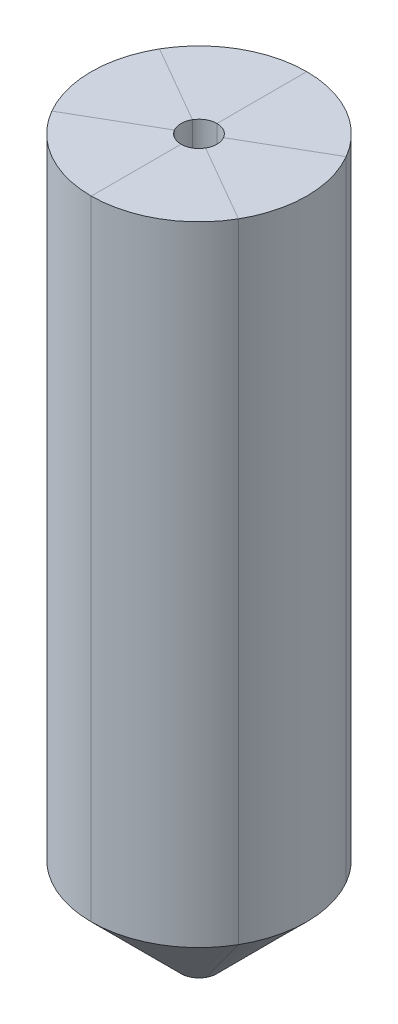
ISO-10303-21;
HEADER;
FILE_DESCRIPTION(('STEP AP214'),'2;1');
FILE_NAME('part.step','',(''),(''),'','','');
FILE_SCHEMA(('AUTOMOTIVE_DESIGN { 1 0 10303 214 1 1 1 1 }'));
ENDSEC;
DATA;
#1=APPLICATION_CONTEXT('core data for automotive mechanical design processes');
#2=APPLICATION_PROTOCOL_DEFINITION('international standard','automotive_design',2000,#1);
#3=PRODUCT_CONTEXT('',#1,'mechanical');
#4=PRODUCT('Part','Part','',(#3));
#5=PRODUCT_RELATED_PRODUCT_CATEGORY('part','',(#4));
#6=PRODUCT_DEFINITION_FORMATION('','',#4);
#7=PRODUCT_DEFINITION_CONTEXT('part definition',#1,'design');
#8=PRODUCT_DEFINITION('design','',#6,#7);
#9=PRODUCT_DEFINITION_SHAPE('','',#8);
#10=(LENGTH_UNIT() NAMED_UNIT(*) SI_UNIT(.MILLI.,.METRE.));
#11=(NAMED_UNIT(*) PLANE_ANGLE_UNIT() SI_UNIT($,.RADIAN.));
#12=(NAMED_UNIT(*) SI_UNIT($,.STERADIAN.) SOLID_ANGLE_UNIT());
#13=UNCERTAINTY_MEASURE_WITH_UNIT(LENGTH_MEASURE(1.E-05),#10,'distance_accuracy_value','');
#14=(GEOMETRIC_REPRESENTATION_CONTEXT(3) GLOBAL_UNCERTAINTY_ASSIGNED_CONTEXT((#13)) GLOBAL_UNIT_ASSIGNED_CONTEXT((#10,
#11,#12)) REPRESENTATION_CONTEXT('',''));
#15=CARTESIAN_POINT('',(0.,0.,0.));
#16=DIRECTION('',(0.,0.,1.));
#17=DIRECTION('',(1.,0.,0.));
#18=AXIS2_PLACEMENT_3D('',#15,#16,#17);
#19=CARTESIAN_POINT('',(0.,254.,0.));
#20=DIRECTION('',(0.,-1.,0.));
#21=DIRECTION('',(0.,0.,-1.));
#22=AXIS2_PLACEMENT_3D('',#19,#20,#21);
#23=CYLINDRICAL_SURFACE('',#22,6.35);
#24=CARTESIAN_POINT('',(0.,0.,0.));
#25=DIRECTION('',(0.,1.,0.));
#26=DIRECTION('',(0.,0.,1.));
#27=AXIS2_PLACEMENT_3D('',#24,#25,#26);
#28=CIRCLE('',#27,6.35);
#29=CARTESIAN_POINT('',(-5.49926131403117,0.,3.17500000000003));
#30=VERTEX_POINT('',#29);
#31=CARTESIAN_POINT('',(0.,0.,6.35));
#32=VERTEX_POINT('',#31);
#33=EDGE_CURVE('E265',#30,#32,#28,.T.);
#34=ORIENTED_EDGE('',*,*,#33,.F.);
#35=DIRECTION('',(0.,-1.,0.));
#36=VECTOR('',#35,1.);
#37=CARTESIAN_POINT('',(-5.49926131403117,254.,3.17500000000003));
#38=LINE('',#37,#36);
#39=CARTESIAN_POINT('',(-5.49926131403117,254.,3.17500000000003));
#40=VERTEX_POINT('',#39);
#41=EDGE_CURVE('E141',#30,#40,#38,.F.);
#42=ORIENTED_EDGE('',*,*,#41,.T.);
#43=CARTESIAN_POINT('',(0.,254.,0.));
#44=DIRECTION('',(0.,1.,0.));
#45=DIRECTION('',(0.,0.,1.));
#46=AXIS2_PLACEMENT_3D('',#43,#44,#45);
#47=CIRCLE('',#46,6.35);
#48=CARTESIAN_POINT('',(0.,254.,6.35));
#49=VERTEX_POINT('',#48);
#50=EDGE_CURVE('E136',#40,#49,#47,.T.);
#51=ORIENTED_EDGE('',*,*,#50,.T.);
#52=DIRECTION('',(0.,-1.,0.));
#53=VECTOR('',#52,1.);
#54=CARTESIAN_POINT('',(0.,254.,6.35));
#55=LINE('',#54,#53);
#56=EDGE_CURVE('E139',#49,#32,#55,.T.);
#57=ORIENTED_EDGE('',*,*,#56,.T.);
#58=EDGE_LOOP('',(#34,#42,#51,#57));
#59=FACE_BOUND('',#58,.T.);
#60=ADVANCED_FACE('F45',(#59),#23,.F.);
#61=CARTESIAN_POINT('',(0.,254.,0.));
#62=DIRECTION('',(0.,-1.,0.));
#63=DIRECTION('',(0.,0.,-1.));
#64=AXIS2_PLACEMENT_3D('',#61,#62,#63);
#65=CYLINDRICAL_SURFACE('',#64,38.1);
#66=DIRECTION('',(0.,-1.,0.));
#67=VECTOR('',#66,1.);
#68=CARTESIAN_POINT('',(-32.995567884187,254.,19.0500000000002));
#69=LINE('',#68,#67);
#70=CARTESIAN_POINT('',(-32.995567884187,31.75,19.0500000000002));
#71=VERTEX_POINT('',#70);
#72=CARTESIAN_POINT('',(-32.995567884187,254.,19.0500000000002));
#73=VERTEX_POINT('',#72);
#74=EDGE_CURVE('E213',#71,#73,#69,.F.);
#75=ORIENTED_EDGE('',*,*,#74,.F.);
#76=CARTESIAN_POINT('',(0.,31.75,0.));
#77=DIRECTION('',(0.,1.,0.));
#78=DIRECTION('',(0.,0.,1.));
#79=AXIS2_PLACEMENT_3D('',#76,#77,#78);
#80=CIRCLE('',#79,38.1);
#81=CARTESIAN_POINT('',(0.,31.75,38.1));
#82=VERTEX_POINT('',#81);
#83=EDGE_CURVE('E56',#71,#82,#80,.T.);
#84=ORIENTED_EDGE('',*,*,#83,.T.);
#85=DIRECTION('',(0.,-1.,0.));
#86=VECTOR('',#85,1.);
#87=CARTESIAN_POINT('',(0.,254.,38.1));
#88=LINE('',#87,#86);
#89=CARTESIAN_POINT('',(0.,254.,38.1));
#90=VERTEX_POINT('',#89);
#91=EDGE_CURVE('E299',#90,#82,#88,.T.);
#92=ORIENTED_EDGE('',*,*,#91,.F.);
#93=CARTESIAN_POINT('',(0.,254.,0.));
#94=DIRECTION('',(0.,1.,0.));
#95=DIRECTION('',(0.,0.,1.));
#96=AXIS2_PLACEMENT_3D('',#93,#94,#95);
#97=CIRCLE('',#96,38.1);
#98=EDGE_CURVE('E168',#73,#90,#97,.T.);
#99=ORIENTED_EDGE('',*,*,#98,.F.);
#100=EDGE_LOOP('',(#75,#84,#92,#99));
#101=FACE_BOUND('',#100,.T.);
#102=ADVANCED_FACE('F298',(#101),#65,.T.);
#103=CARTESIAN_POINT('',(0.,254.,0.));
#104=DIRECTION('',(0.,1.,0.));
#105=DIRECTION('',(0.,0.,1.));
#106=AXIS2_PLACEMENT_3D('',#103,#104,#105);
#107=PLANE('',#106);
#108=ORIENTED_EDGE('',*,*,#50,.F.);
#109=DIRECTION('',(-0.866025403784436,0.,0.500000000000004));
#110=VECTOR('',#109,1.);
#111=CARTESIAN_POINT('',(0.,254.,0.));
#112=LINE('',#111,#110);
#113=EDGE_CURVE('E211',#40,#73,#112,.T.);
#114=ORIENTED_EDGE('',*,*,#113,.T.);
#115=ORIENTED_EDGE('',*,*,#98,.T.);
#116=DIRECTION('',(0.,0.,-1.));
#117=VECTOR('',#116,1.);
#118=CARTESIAN_POINT('',(0.,254.,0.));
#119=LINE('',#118,#117);
#120=EDGE_CURVE('E165',#90,#49,#119,.T.);
#121=ORIENTED_EDGE('',*,*,#120,.T.);
#122=EDGE_LOOP('',(#108,#114,#115,#121));
#123=FACE_BOUND('',#122,.T.);
#124=ADVANCED_FACE('F166',(#123),#107,.T.);
#125=DIRECTION('',(0.,-1.,0.));
#126=VECTOR('',#125,1.);
#127=CARTESIAN_POINT('',(32.9955678841872,254.,19.0499999999999));
#128=LINE('',#127,#126);
#129=CARTESIAN_POINT('',(32.9955678841872,254.,19.0499999999999));
#130=VERTEX_POINT('',#129);
#131=CARTESIAN_POINT('',(32.9955678841872,31.75,19.0499999999999));
#132=VERTEX_POINT('',#131);
#133=EDGE_CURVE('E313',#130,#132,#128,.T.);
#134=ORIENTED_EDGE('',*,*,#133,.T.);
#135=CARTESIAN_POINT('',(0.,31.75,0.));
#136=DIRECTION('',(0.,1.,0.));
#137=DIRECTION('',(0.,0.,1.));
#138=AXIS2_PLACEMENT_3D('',#135,#136,#137);
#139=CIRCLE('',#138,38.1);
#140=CARTESIAN_POINT('',(32.995567884187,31.75,-19.0500000000002));
#141=VERTEX_POINT('',#140);
#142=EDGE_CURVE('E230',#132,#141,#139,.T.);
#143=ORIENTED_EDGE('',*,*,#142,.T.);
#144=DIRECTION('',(0.,-1.,0.));
#145=VECTOR('',#144,1.);
#146=CARTESIAN_POINT('',(32.995567884187,254.,-19.0500000000002));
#147=LINE('',#146,#145);
#148=CARTESIAN_POINT('',(32.995567884187,254.,-19.0500000000002));
#149=VERTEX_POINT('',#148);
#150=EDGE_CURVE('E214',#149,#141,#147,.T.);
#151=ORIENTED_EDGE('',*,*,#150,.F.);
#152=EDGE_CURVE('E348',#130,#149,#97,.T.);
#153=ORIENTED_EDGE('',*,*,#152,.F.);
#154=EDGE_LOOP('',(#134,#143,#151,#153));
#155=FACE_BOUND('',#154,.T.);
#156=ADVANCED_FACE('F339',(#155),#65,.T.);
#157=ORIENTED_EDGE('',*,*,#152,.T.);
#158=DIRECTION('',(-0.866025403784436,0.,0.500000000000004));
#159=VECTOR('',#158,1.);
#160=CARTESIAN_POINT('',(0.,254.,0.));
#161=LINE('',#160,#159);
#162=CARTESIAN_POINT('',(5.49926131403117,254.,-3.17500000000003));
#163=VERTEX_POINT('',#162);
#164=EDGE_CURVE('E221',#149,#163,#161,.T.);
#165=ORIENTED_EDGE('',*,*,#164,.T.);
#166=CARTESIAN_POINT('',(5.49926131403119,254.,3.17499999999999));
#167=VERTEX_POINT('',#166);
#168=EDGE_CURVE('E182',#167,#163,#47,.T.);
#169=ORIENTED_EDGE('',*,*,#168,.F.);
#170=DIRECTION('',(-0.86602540378444,0.,-0.499999999999998));
#171=VECTOR('',#170,1.);
#172=CARTESIAN_POINT('',(0.,254.,0.));
#173=LINE('',#172,#171);
#174=EDGE_CURVE('E179',#130,#167,#173,.T.);
#175=ORIENTED_EDGE('',*,*,#174,.F.);
#176=EDGE_LOOP('',(#157,#165,#169,#175));
#177=FACE_BOUND('',#176,.T.);
#178=ADVANCED_FACE('F351',(#177),#107,.T.);
#179=ORIENTED_EDGE('',*,*,#168,.T.);
#180=DIRECTION('',(0.,-1.,0.));
#181=VECTOR('',#180,1.);
#182=CARTESIAN_POINT('',(5.49926131403117,254.,-3.17500000000002));
#183=LINE('',#182,#181);
#184=CARTESIAN_POINT('',(5.49926131403117,0.,-3.17500000000003));
#185=VERTEX_POINT('',#184);
#186=EDGE_CURVE('E227',#163,#185,#183,.T.);
#187=ORIENTED_EDGE('',*,*,#186,.T.);
#188=CARTESIAN_POINT('',(5.49926131403119,0.,3.17499999999999));
#189=VERTEX_POINT('',#188);
#190=EDGE_CURVE('E276',#189,#185,#28,.T.);
#191=ORIENTED_EDGE('',*,*,#190,.F.);
#192=DIRECTION('',(0.,-1.,0.));
#193=VECTOR('',#192,1.);
#194=CARTESIAN_POINT('',(5.49926131403119,254.,3.17499999999999));
#195=LINE('',#194,#193);
#196=EDGE_CURVE('E161',#167,#189,#195,.T.);
#197=ORIENTED_EDGE('',*,*,#196,.F.);
#198=EDGE_LOOP('',(#179,#187,#191,#197));
#199=FACE_BOUND('',#198,.T.);
#200=ADVANCED_FACE('F327',(#199),#23,.F.);
#201=ORIENTED_EDGE('',*,*,#41,.F.);
#202=CARTESIAN_POINT('',(-5.4992613140312,0.,-3.17499999999998));
#203=VERTEX_POINT('',#202);
#204=EDGE_CURVE('E270',#203,#30,#28,.T.);
#205=ORIENTED_EDGE('',*,*,#204,.F.);
#206=DIRECTION('',(0.,-1.,0.));
#207=VECTOR('',#206,1.);
#208=CARTESIAN_POINT('',(-5.4992613140312,254.,-3.17499999999998));
#209=LINE('',#208,#207);
#210=CARTESIAN_POINT('',(-5.4992613140312,254.,-3.17499999999998));
#211=VERTEX_POINT('',#210);
#212=EDGE_CURVE('E203',#203,#211,#209,.F.);
#213=ORIENTED_EDGE('',*,*,#212,.T.);
#214=EDGE_CURVE('E148',#211,#40,#47,.T.);
#215=ORIENTED_EDGE('',*,*,#214,.T.);
#216=EDGE_LOOP('',(#201,#205,#213,#215));
#217=FACE_BOUND('',#216,.T.);
#218=ADVANCED_FACE('F201',(#217),#23,.F.);
#219=DIRECTION('',(0.,-1.,0.));
#220=VECTOR('',#219,1.);
#221=CARTESIAN_POINT('',(-32.9955678841872,254.,-19.0499999999999));
#222=LINE('',#221,#220);
#223=CARTESIAN_POINT('',(-32.9955678841872,31.75,-19.0499999999999));
#224=VERTEX_POINT('',#223);
#225=CARTESIAN_POINT('',(-32.9955678841872,254.,-19.0499999999999));
#226=VERTEX_POINT('',#225);
#227=EDGE_CURVE('E291',#224,#226,#222,.F.);
#228=ORIENTED_EDGE('',*,*,#227,.F.);
#229=CARTESIAN_POINT('',(0.,31.75,0.));
#230=DIRECTION('',(0.,1.,0.));
#231=DIRECTION('',(0.,0.,1.));
#232=AXIS2_PLACEMENT_3D('',#229,#230,#231);
#233=CIRCLE('',#232,38.1);
#234=EDGE_CURVE('E11',#224,#71,#233,.T.);
#235=ORIENTED_EDGE('',*,*,#234,.T.);
#236=ORIENTED_EDGE('',*,*,#74,.T.);
#237=EDGE_CURVE('E186',#226,#73,#97,.T.);
#238=ORIENTED_EDGE('',*,*,#237,.F.);
#239=EDGE_LOOP('',(#228,#235,#236,#238));
#240=FACE_BOUND('',#239,.T.);
#241=ADVANCED_FACE('F361',(#240),#65,.T.);
#242=ORIENTED_EDGE('',*,*,#113,.F.);
#243=ORIENTED_EDGE('',*,*,#214,.F.);
#244=DIRECTION('',(-0.86602540378444,0.,-0.499999999999998));
#245=VECTOR('',#244,1.);
#246=CARTESIAN_POINT('',(0.,254.,0.));
#247=LINE('',#246,#245);
#248=EDGE_CURVE('E209',#211,#226,#247,.T.);
#249=ORIENTED_EDGE('',*,*,#248,.T.);
#250=ORIENTED_EDGE('',*,*,#237,.T.);
#251=EDGE_LOOP('',(#242,#243,#249,#250));
#252=FACE_BOUND('',#251,.T.);
#253=ADVANCED_FACE('F207',(#252),#107,.T.);
#254=ORIENTED_EDGE('',*,*,#91,.T.);
#255=CARTESIAN_POINT('',(0.,31.75,0.));
#256=DIRECTION('',(0.,1.,0.));
#257=DIRECTION('',(0.,0.,1.));
#258=AXIS2_PLACEMENT_3D('',#255,#256,#257);
#259=CIRCLE('',#258,38.1);
#260=EDGE_CURVE('E237',#82,#132,#259,.T.);
#261=ORIENTED_EDGE('',*,*,#260,.T.);
#262=ORIENTED_EDGE('',*,*,#133,.F.);
#263=EDGE_CURVE('E189',#90,#130,#97,.T.);
#264=ORIENTED_EDGE('',*,*,#263,.F.);
#265=EDGE_LOOP('',(#254,#261,#262,#264));
#266=FACE_BOUND('',#265,.T.);
#267=ADVANCED_FACE('F301',(#266),#65,.T.);
#268=ORIENTED_EDGE('',*,*,#263,.T.);
#269=ORIENTED_EDGE('',*,*,#174,.T.);
#270=EDGE_CURVE('E152',#49,#167,#47,.T.);
#271=ORIENTED_EDGE('',*,*,#270,.F.);
#272=ORIENTED_EDGE('',*,*,#120,.F.);
#273=EDGE_LOOP('',(#268,#269,#271,#272));
#274=FACE_BOUND('',#273,.T.);
#275=ADVANCED_FACE('F177',(#274),#107,.T.);
#276=ORIENTED_EDGE('',*,*,#270,.T.);
#277=ORIENTED_EDGE('',*,*,#196,.T.);
#278=EDGE_CURVE('E149',#32,#189,#28,.T.);
#279=ORIENTED_EDGE('',*,*,#278,.F.);
#280=ORIENTED_EDGE('',*,*,#56,.F.);
#281=EDGE_LOOP('',(#276,#277,#279,#280));
#282=FACE_BOUND('',#281,.T.);
#283=ADVANCED_FACE('F155',(#282),#23,.F.);
#284=ORIENTED_EDGE('',*,*,#212,.F.);
#285=CARTESIAN_POINT('',(0.,0.,-6.35));
#286=VERTEX_POINT('',#285);
#287=EDGE_CURVE('E275',#286,#203,#28,.T.);
#288=ORIENTED_EDGE('',*,*,#287,.F.);
#289=DIRECTION('',(0.,-1.,0.));
#290=VECTOR('',#289,1.);
#291=CARTESIAN_POINT('',(0.,254.,-6.35));
#292=LINE('',#291,#290);
#293=CARTESIAN_POINT('',(0.,254.,-6.35));
#294=VERTEX_POINT('',#293);
#295=EDGE_CURVE('E162',#286,#294,#292,.F.);
#296=ORIENTED_EDGE('',*,*,#295,.T.);
#297=EDGE_CURVE('E183',#294,#211,#47,.T.);
#298=ORIENTED_EDGE('',*,*,#297,.T.);
#299=EDGE_LOOP('',(#284,#288,#296,#298));
#300=FACE_BOUND('',#299,.T.);
#301=ADVANCED_FACE('F288',(#300),#23,.F.);
#302=DIRECTION('',(0.,-1.,0.));
#303=VECTOR('',#302,1.);
#304=CARTESIAN_POINT('',(0.,254.,-38.1));
#305=LINE('',#304,#303);
#306=CARTESIAN_POINT('',(0.,31.75,-38.1));
#307=VERTEX_POINT('',#306);
#308=CARTESIAN_POINT('',(0.,254.,-38.1));
#309=VERTEX_POINT('',#308);
#310=EDGE_CURVE('E174',#307,#309,#305,.F.);
#311=ORIENTED_EDGE('',*,*,#310,.F.);
#312=CARTESIAN_POINT('',(0.,31.75,0.));
#313=DIRECTION('',(0.,1.,0.));
#314=DIRECTION('',(0.,0.,1.));
#315=AXIS2_PLACEMENT_3D('',#312,#313,#314);
#316=CIRCLE('',#315,38.1);
#317=EDGE_CURVE('E70',#307,#224,#316,.T.);
#318=ORIENTED_EDGE('',*,*,#317,.T.);
#319=ORIENTED_EDGE('',*,*,#227,.T.);
#320=EDGE_CURVE('E349',#309,#226,#97,.T.);
#321=ORIENTED_EDGE('',*,*,#320,.F.);
#322=EDGE_LOOP('',(#311,#318,#319,#321));
#323=FACE_BOUND('',#322,.T.);
#324=ADVANCED_FACE('F360',(#323),#65,.T.);
#325=ORIENTED_EDGE('',*,*,#248,.F.);
#326=ORIENTED_EDGE('',*,*,#297,.F.);
#327=EDGE_CURVE('E175',#294,#309,#119,.T.);
#328=ORIENTED_EDGE('',*,*,#327,.T.);
#329=ORIENTED_EDGE('',*,*,#320,.T.);
#330=EDGE_LOOP('',(#325,#326,#328,#329));
#331=FACE_BOUND('',#330,.T.);
#332=ADVANCED_FACE('F359',(#331),#107,.T.);
#333=ORIENTED_EDGE('',*,*,#150,.T.);
#334=CARTESIAN_POINT('',(0.,31.75,0.));
#335=DIRECTION('',(0.,1.,0.));
#336=DIRECTION('',(0.,0.,1.));
#337=AXIS2_PLACEMENT_3D('',#334,#335,#336);
#338=CIRCLE('',#337,38.1);
#339=EDGE_CURVE('E234',#141,#307,#338,.T.);
#340=ORIENTED_EDGE('',*,*,#339,.T.);
#341=ORIENTED_EDGE('',*,*,#310,.T.);
#342=EDGE_CURVE('E188',#149,#309,#97,.T.);
#343=ORIENTED_EDGE('',*,*,#342,.F.);
#344=EDGE_LOOP('',(#333,#340,#341,#343));
#345=FACE_BOUND('',#344,.T.);
#346=ADVANCED_FACE('F343',(#345),#65,.T.);
#347=ORIENTED_EDGE('',*,*,#164,.F.);
#348=ORIENTED_EDGE('',*,*,#342,.T.);
#349=ORIENTED_EDGE('',*,*,#327,.F.);
#350=EDGE_CURVE('E151',#163,#294,#47,.T.);
#351=ORIENTED_EDGE('',*,*,#350,.F.);
#352=EDGE_LOOP('',(#347,#348,#349,#351));
#353=FACE_BOUND('',#352,.T.);
#354=ADVANCED_FACE('F380',(#353),#107,.T.);
#355=ORIENTED_EDGE('',*,*,#186,.F.);
#356=ORIENTED_EDGE('',*,*,#350,.T.);
#357=ORIENTED_EDGE('',*,*,#295,.F.);
#358=EDGE_CURVE('E271',#185,#286,#28,.T.);
#359=ORIENTED_EDGE('',*,*,#358,.F.);
#360=EDGE_LOOP('',(#355,#356,#357,#359));
#361=FACE_BOUND('',#360,.T.);
#362=ADVANCED_FACE('F374',(#361),#23,.F.);
#363=CARTESIAN_POINT('',(0.,31.75,0.));
#364=DIRECTION('',(0.,1.,0.));
#365=DIRECTION('',(0.,0.,1.));
#366=AXIS2_PLACEMENT_3D('',#363,#364,#365);
#367=CONICAL_SURFACE('',#366,38.1,0.78539816339745);
#368=DIRECTION('',(-0.612372435695797,0.707106781186546,-0.353553390593273));
#369=VECTOR('',#368,1.);
#370=CARTESIAN_POINT('',(-5.49926131403107,0.,-3.17499999999991));
#371=LINE('',#370,#369);
#372=EDGE_CURVE('E257',#203,#224,#371,.T.);
#373=ORIENTED_EDGE('',*,*,#372,.F.);
#374=ORIENTED_EDGE('',*,*,#204,.T.);
#375=DIRECTION('',(0.612372435695794,-0.707106781186546,-0.353553390593278));
#376=VECTOR('',#375,1.);
#377=CARTESIAN_POINT('',(-32.995567884187,31.75,19.0500000000002));
#378=LINE('',#377,#376);
#379=EDGE_CURVE('E50',#71,#30,#378,.T.);
#380=ORIENTED_EDGE('',*,*,#379,.F.);
#381=ORIENTED_EDGE('',*,*,#234,.F.);
#382=EDGE_LOOP('',(#373,#374,#380,#381));
#383=FACE_BOUND('',#382,.T.);
#384=ADVANCED_FACE('F48',(#383),#367,.T.);
#385=CARTESIAN_POINT('',(0.,31.75,0.));
#386=DIRECTION('',(0.,1.,0.));
#387=DIRECTION('',(0.,0.,1.));
#388=AXIS2_PLACEMENT_3D('',#385,#386,#387);
#389=CONICAL_SURFACE('',#388,38.1,0.78539816339745);
#390=ORIENTED_EDGE('',*,*,#379,.T.);
#391=ORIENTED_EDGE('',*,*,#33,.T.);
#392=DIRECTION('',(0.,-0.707106781186546,-0.707106781186549));
#393=VECTOR('',#392,1.);
#394=CARTESIAN_POINT('',(0.,31.75,38.1));
#395=LINE('',#394,#393);
#396=EDGE_CURVE('E254',#82,#32,#395,.T.);
#397=ORIENTED_EDGE('',*,*,#396,.F.);
#398=ORIENTED_EDGE('',*,*,#83,.F.);
#399=EDGE_LOOP('',(#390,#391,#397,#398));
#400=FACE_BOUND('',#399,.T.);
#401=ADVANCED_FACE('F294',(#400),#389,.T.);
#402=CARTESIAN_POINT('',(0.,31.75,0.));
#403=DIRECTION('',(0.,1.,0.));
#404=DIRECTION('',(0.,0.,1.));
#405=AXIS2_PLACEMENT_3D('',#402,#403,#404);
#406=CONICAL_SURFACE('',#405,38.1,0.78539816339745);
#407=ORIENTED_EDGE('',*,*,#372,.T.);
#408=ORIENTED_EDGE('',*,*,#317,.F.);
#409=DIRECTION('',(0.,0.707106781186546,-0.707106781186549));
#410=VECTOR('',#409,1.);
#411=CARTESIAN_POINT('',(0.,0.,-6.34999999999986));
#412=LINE('',#411,#410);
#413=EDGE_CURVE('E250',#286,#307,#412,.T.);
#414=ORIENTED_EDGE('',*,*,#413,.F.);
#415=ORIENTED_EDGE('',*,*,#287,.T.);
#416=EDGE_LOOP('',(#407,#408,#414,#415));
#417=FACE_BOUND('',#416,.T.);
#418=ADVANCED_FACE('F287',(#417),#406,.T.);
#419=CARTESIAN_POINT('',(0.,31.75,0.));
#420=DIRECTION('',(0.,1.,0.));
#421=DIRECTION('',(0.,0.,1.));
#422=AXIS2_PLACEMENT_3D('',#419,#420,#421);
#423=CONICAL_SURFACE('',#422,38.1,0.78539816339745);
#424=ORIENTED_EDGE('',*,*,#396,.T.);
#425=ORIENTED_EDGE('',*,*,#278,.T.);
#426=DIRECTION('',(-0.612372435695797,-0.707106781186546,-0.353553390593273));
#427=VECTOR('',#426,1.);
#428=CARTESIAN_POINT('',(32.9955678841872,31.75,19.0499999999999));
#429=LINE('',#428,#427);
#430=EDGE_CURVE('E247',#132,#189,#429,.T.);
#431=ORIENTED_EDGE('',*,*,#430,.F.);
#432=ORIENTED_EDGE('',*,*,#260,.F.);
#433=EDGE_LOOP('',(#424,#425,#431,#432));
#434=FACE_BOUND('',#433,.T.);
#435=ADVANCED_FACE('F567',(#434),#423,.T.);
#436=CARTESIAN_POINT('',(0.,31.75,0.));
#437=DIRECTION('',(0.,1.,0.));
#438=DIRECTION('',(0.,0.,1.));
#439=AXIS2_PLACEMENT_3D('',#436,#437,#438);
#440=CONICAL_SURFACE('',#439,38.1,0.78539816339745);
#441=ORIENTED_EDGE('',*,*,#413,.T.);
#442=ORIENTED_EDGE('',*,*,#339,.F.);
#443=DIRECTION('',(0.612372435695794,0.707106781186546,-0.353553390593278));
#444=VECTOR('',#443,1.);
#445=CARTESIAN_POINT('',(5.49926131403105,0.,-3.17499999999995));
#446=LINE('',#445,#444);
#447=EDGE_CURVE('E244',#185,#141,#446,.T.);
#448=ORIENTED_EDGE('',*,*,#447,.F.);
#449=ORIENTED_EDGE('',*,*,#358,.T.);
#450=EDGE_LOOP('',(#441,#442,#448,#449));
#451=FACE_BOUND('',#450,.T.);
#452=ADVANCED_FACE('F336',(#451),#440,.T.);
#453=CARTESIAN_POINT('',(0.,31.75,0.));
#454=DIRECTION('',(0.,1.,0.));
#455=DIRECTION('',(0.,0.,1.));
#456=AXIS2_PLACEMENT_3D('',#453,#454,#455);
#457=CONICAL_SURFACE('',#456,38.1,0.78539816339745);
#458=ORIENTED_EDGE('',*,*,#430,.T.);
#459=ORIENTED_EDGE('',*,*,#190,.T.);
#460=ORIENTED_EDGE('',*,*,#447,.T.);
#461=ORIENTED_EDGE('',*,*,#142,.F.);
#462=EDGE_LOOP('',(#458,#459,#460,#461));
#463=FACE_BOUND('',#462,.T.);
#464=ADVANCED_FACE('F332',(#463),#457,.T.);
#465=CLOSED_SHELL('',(#60,#102,#124,#156,#178,#200,#218,#241,#253,#267,#275,#283,#301,#324,#332,
#346,#354,#362,#384,#401,#418,#435,#452,#464));
#466=MANIFOLD_SOLID_BREP('B2',#465);
#467=ADVANCED_BREP_SHAPE_REPRESENTATION('',(#18,#466),#14);
#468=SHAPE_DEFINITION_REPRESENTATION(#9,#467);
ENDSEC;
END-ISO-10303-21;
